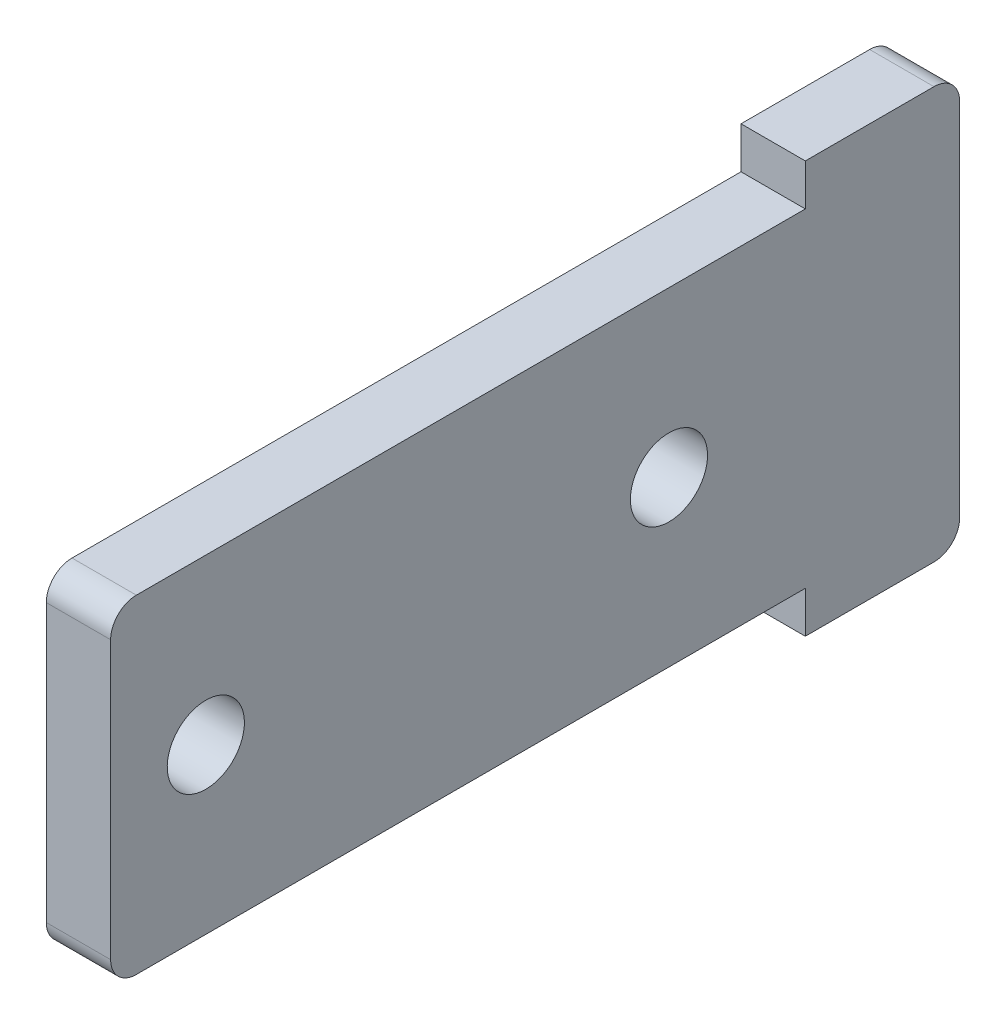
ISO-10303-21;
HEADER;
FILE_DESCRIPTION(('STEP AP214'),'2;1');
FILE_NAME('part.step','',(''),(''),'','','');
FILE_SCHEMA(('AUTOMOTIVE_DESIGN { 1 0 10303 214 1 1 1 1 }'));
ENDSEC;
DATA;
#1=APPLICATION_CONTEXT('core data for automotive mechanical design processes');
#2=APPLICATION_PROTOCOL_DEFINITION('international standard','automotive_design',2000,#1);
#3=PRODUCT_CONTEXT('',#1,'mechanical');
#4=PRODUCT('Part','Part','',(#3));
#5=PRODUCT_RELATED_PRODUCT_CATEGORY('part','',(#4));
#6=PRODUCT_DEFINITION_FORMATION('','',#4);
#7=PRODUCT_DEFINITION_CONTEXT('part definition',#1,'design');
#8=PRODUCT_DEFINITION('design','',#6,#7);
#9=PRODUCT_DEFINITION_SHAPE('','',#8);
#10=(LENGTH_UNIT() NAMED_UNIT(*) SI_UNIT(.MILLI.,.METRE.));
#11=(NAMED_UNIT(*) PLANE_ANGLE_UNIT() SI_UNIT($,.RADIAN.));
#12=(NAMED_UNIT(*) SI_UNIT($,.STERADIAN.) SOLID_ANGLE_UNIT());
#13=UNCERTAINTY_MEASURE_WITH_UNIT(LENGTH_MEASURE(1.E-05),#10,'distance_accuracy_value','');
#14=(GEOMETRIC_REPRESENTATION_CONTEXT(3) GLOBAL_UNCERTAINTY_ASSIGNED_CONTEXT((#13)) GLOBAL_UNIT_ASSIGNED_CONTEXT((#10,
#11,#12)) REPRESENTATION_CONTEXT('',''));
#15=CARTESIAN_POINT('',(0.,0.,0.));
#16=DIRECTION('',(0.,0.,1.));
#17=DIRECTION('',(1.,0.,0.));
#18=AXIS2_PLACEMENT_3D('',#15,#16,#17);
#19=CARTESIAN_POINT('',(-139.654437837841,-38.0629308707487,10.5));
#20=DIRECTION('',(1.,0.,0.));
#21=DIRECTION('',(0.,1.,0.));
#22=AXIS2_PLACEMENT_3D('',#19,#20,#21);
#23=PLANE('',#22);
#24=CARTESIAN_POINT('',(-139.654437837841,-38.0629740155527,23.3));
#25=DIRECTION('',(1.,0.,0.));
#26=DIRECTION('',(0.,1.,0.));
#27=AXIS2_PLACEMENT_3D('',#24,#25,#26);
#28=CIRCLE('',#27,1.5);
#29=CARTESIAN_POINT('',(-139.654437837841,-39.5629740155527,23.3));
#30=VERTEX_POINT('',#29);
#31=EDGE_CURVE('E216',#30,#30,#28,.T.);
#32=ORIENTED_EDGE('',*,*,#31,.T.);
#33=EDGE_LOOP('',(#32));
#34=FACE_BOUND('',#33,.T.);
#35=CARTESIAN_POINT('',(-139.654437837841,-38.0629740155527,5.3));
#36=DIRECTION('',(1.,0.,0.));
#37=DIRECTION('',(0.,1.,0.));
#38=AXIS2_PLACEMENT_3D('',#35,#36,#37);
#39=CIRCLE('',#38,1.5);
#40=CARTESIAN_POINT('',(-139.654437837841,-39.5629740155527,5.3));
#41=VERTEX_POINT('',#40);
#42=EDGE_CURVE('E199',#41,#41,#39,.T.);
#43=ORIENTED_EDGE('',*,*,#42,.T.);
#44=EDGE_LOOP('',(#43));
#45=FACE_BOUND('',#44,.T.);
#46=DIRECTION('',(0.,0.,-1.));
#47=VECTOR('',#46,1.);
#48=CARTESIAN_POINT('',(-139.654437837841,-31.6789674393649,3.));
#49=LINE('',#48,#47);
#50=CARTESIAN_POINT('',(-139.654437837841,-31.6789674393649,26.));
#51=VERTEX_POINT('',#50);
#52=CARTESIAN_POINT('',(-139.654437837841,-31.6789673021326,0.));
#53=VERTEX_POINT('',#52);
#54=EDGE_CURVE('E9',#51,#53,#49,.T.);
#55=ORIENTED_EDGE('',*,*,#54,.T.);
#56=DIRECTION('',(0.,1.,0.));
#57=VECTOR('',#56,1.);
#58=CARTESIAN_POINT('',(-139.654437837841,-31.6789673021326,0.));
#59=LINE('',#58,#57);
#60=CARTESIAN_POINT('',(-139.654437837841,-30.0629308707487,0.));
#61=VERTEX_POINT('',#60);
#62=EDGE_CURVE('E209',#53,#61,#59,.T.);
#63=ORIENTED_EDGE('',*,*,#62,.T.);
#64=DIRECTION('',(0.,0.,-1.));
#65=VECTOR('',#64,1.);
#66=CARTESIAN_POINT('',(-139.654437837841,-30.0629308707487,0.));
#67=LINE('',#66,#65);
#68=CARTESIAN_POINT('',(-139.654437837841,-30.0629308707487,-5.));
#69=VERTEX_POINT('',#68);
#70=EDGE_CURVE('E291',#61,#69,#67,.T.);
#71=ORIENTED_EDGE('',*,*,#70,.T.);
#72=CARTESIAN_POINT('',(-139.654437837841,-31.0629308707487,-5.));
#73=DIRECTION('',(-1.,0.,0.));
#74=DIRECTION('',(0.,0.,-1.));
#75=AXIS2_PLACEMENT_3D('',#72,#73,#74);
#76=CIRCLE('',#75,1.);
#77=CARTESIAN_POINT('',(-139.654437837841,-31.0629308707487,-6.));
#78=VERTEX_POINT('',#77);
#79=EDGE_CURVE('E211',#69,#78,#76,.T.);
#80=ORIENTED_EDGE('',*,*,#79,.T.);
#81=DIRECTION('',(0.,-1.,0.));
#82=VECTOR('',#81,1.);
#83=CARTESIAN_POINT('',(-139.654437837841,-31.0629308707487,-6.));
#84=LINE('',#83,#82);
#85=CARTESIAN_POINT('',(-139.654437837841,-45.0629308707487,-6.));
#86=VERTEX_POINT('',#85);
#87=EDGE_CURVE('E228',#78,#86,#84,.T.);
#88=ORIENTED_EDGE('',*,*,#87,.T.);
#89=CARTESIAN_POINT('',(-139.654437837841,-45.0629308707487,-5.));
#90=DIRECTION('',(-1.,0.,0.));
#91=DIRECTION('',(0.,-1.,0.));
#92=AXIS2_PLACEMENT_3D('',#89,#90,#91);
#93=CIRCLE('',#92,1.);
#94=CARTESIAN_POINT('',(-139.654437837841,-46.0629308707487,-5.));
#95=VERTEX_POINT('',#94);
#96=EDGE_CURVE('E221',#86,#95,#93,.T.);
#97=ORIENTED_EDGE('',*,*,#96,.T.);
#98=DIRECTION('',(0.,0.,1.));
#99=VECTOR('',#98,1.);
#100=CARTESIAN_POINT('',(-139.654437837841,-46.0629308707487,-5.));
#101=LINE('',#100,#99);
#102=CARTESIAN_POINT('',(-139.654437837841,-46.0629308707487,0.));
#103=VERTEX_POINT('',#102);
#104=EDGE_CURVE('E129',#95,#103,#101,.T.);
#105=ORIENTED_EDGE('',*,*,#104,.T.);
#106=DIRECTION('',(0.,1.,0.));
#107=VECTOR('',#106,1.);
#108=CARTESIAN_POINT('',(-139.654437837841,-93.4629740155527,0.));
#109=LINE('',#108,#107);
#110=CARTESIAN_POINT('',(-139.654437837841,-44.4468944393649,0.));
#111=VERTEX_POINT('',#110);
#112=EDGE_CURVE('E255',#103,#111,#109,.T.);
#113=ORIENTED_EDGE('',*,*,#112,.T.);
#114=DIRECTION('',(0.,0.,1.));
#115=VECTOR('',#114,1.);
#116=CARTESIAN_POINT('',(-139.654437837841,-44.4468944393649,26.));
#117=LINE('',#116,#115);
#118=CARTESIAN_POINT('',(-139.654437837841,-44.4468944393649,26.));
#119=VERTEX_POINT('',#118);
#120=EDGE_CURVE('E240',#111,#119,#117,.T.);
#121=ORIENTED_EDGE('',*,*,#120,.T.);
#122=CARTESIAN_POINT('',(-139.654437837841,-43.4468944393649,26.));
#123=DIRECTION('',(-1.,0.,0.));
#124=DIRECTION('',(0.,0.,1.));
#125=AXIS2_PLACEMENT_3D('',#122,#123,#124);
#126=CIRCLE('',#125,1.);
#127=CARTESIAN_POINT('',(-139.654437837841,-43.4468944393649,27.));
#128=VERTEX_POINT('',#127);
#129=EDGE_CURVE('E195',#119,#128,#126,.T.);
#130=ORIENTED_EDGE('',*,*,#129,.T.);
#131=DIRECTION('',(0.,1.,0.));
#132=VECTOR('',#131,1.);
#133=CARTESIAN_POINT('',(-139.654437837841,-32.6789674393649,27.));
#134=LINE('',#133,#132);
#135=CARTESIAN_POINT('',(-139.654437837841,-32.6789674393649,27.));
#136=VERTEX_POINT('',#135);
#137=EDGE_CURVE('E204',#128,#136,#134,.T.);
#138=ORIENTED_EDGE('',*,*,#137,.T.);
#139=CARTESIAN_POINT('',(-139.654437837841,-32.6789674393649,26.));
#140=DIRECTION('',(-1.,0.,0.));
#141=DIRECTION('',(0.,1.,0.));
#142=AXIS2_PLACEMENT_3D('',#139,#140,#141);
#143=CIRCLE('',#142,1.);
#144=EDGE_CURVE('E172',#136,#51,#143,.T.);
#145=ORIENTED_EDGE('',*,*,#144,.T.);
#146=EDGE_LOOP('',(#55,#63,#71,#80,#88,#97,#105,#113,#121,#130,#138,#145));
#147=FACE_BOUND('',#146,.T.);
#148=ADVANCED_FACE('F15',(#34,#45,#147),#23,.F.);
#149=CARTESIAN_POINT('',(-137.154437837841,-38.0629308707487,10.5));
#150=DIRECTION('',(1.,0.,0.));
#151=DIRECTION('',(0.,1.,0.));
#152=AXIS2_PLACEMENT_3D('',#149,#150,#151);
#153=PLANE('',#152);
#154=CARTESIAN_POINT('',(-137.154437837841,-38.0629740155527,23.3));
#155=DIRECTION('',(-1.,0.,0.));
#156=DIRECTION('',(0.,1.,0.));
#157=AXIS2_PLACEMENT_3D('',#154,#155,#156);
#158=CIRCLE('',#157,1.5);
#159=CARTESIAN_POINT('',(-137.154437837841,-39.5629740155527,23.3));
#160=VERTEX_POINT('',#159);
#161=EDGE_CURVE('E203',#160,#160,#158,.T.);
#162=ORIENTED_EDGE('',*,*,#161,.T.);
#163=EDGE_LOOP('',(#162));
#164=FACE_BOUND('',#163,.T.);
#165=CARTESIAN_POINT('',(-137.154437837841,-38.0629740155527,5.3));
#166=DIRECTION('',(-1.,0.,0.));
#167=DIRECTION('',(0.,1.,0.));
#168=AXIS2_PLACEMENT_3D('',#165,#166,#167);
#169=CIRCLE('',#168,1.5);
#170=CARTESIAN_POINT('',(-137.154437837841,-39.5629740155527,5.3));
#171=VERTEX_POINT('',#170);
#172=EDGE_CURVE('E177',#171,#171,#169,.T.);
#173=ORIENTED_EDGE('',*,*,#172,.T.);
#174=EDGE_LOOP('',(#173));
#175=FACE_BOUND('',#174,.T.);
#176=DIRECTION('',(0.,0.,1.));
#177=VECTOR('',#176,1.);
#178=CARTESIAN_POINT('',(-137.154437837841,-31.6789674393649,3.));
#179=LINE('',#178,#177);
#180=CARTESIAN_POINT('',(-137.154437837841,-31.6789673021326,0.));
#181=VERTEX_POINT('',#180);
#182=CARTESIAN_POINT('',(-137.154437837841,-31.6789674393649,26.));
#183=VERTEX_POINT('',#182);
#184=EDGE_CURVE('E25',#181,#183,#179,.T.);
#185=ORIENTED_EDGE('',*,*,#184,.T.);
#186=CARTESIAN_POINT('',(-137.154437837841,-32.6789674393649,26.));
#187=DIRECTION('',(1.,0.,0.));
#188=DIRECTION('',(0.,1.,0.));
#189=AXIS2_PLACEMENT_3D('',#186,#187,#188);
#190=CIRCLE('',#189,1.);
#191=CARTESIAN_POINT('',(-137.154437837841,-32.6789674393649,27.));
#192=VERTEX_POINT('',#191);
#193=EDGE_CURVE('E159',#183,#192,#190,.T.);
#194=ORIENTED_EDGE('',*,*,#193,.T.);
#195=DIRECTION('',(0.,-1.,0.));
#196=VECTOR('',#195,1.);
#197=CARTESIAN_POINT('',(-137.154437837841,-32.6789674393649,27.));
#198=LINE('',#197,#196);
#199=CARTESIAN_POINT('',(-137.154437837841,-43.4468944393649,27.));
#200=VERTEX_POINT('',#199);
#201=EDGE_CURVE('E151',#192,#200,#198,.T.);
#202=ORIENTED_EDGE('',*,*,#201,.T.);
#203=CARTESIAN_POINT('',(-137.154437837841,-43.4468944393649,26.));
#204=DIRECTION('',(1.,0.,0.));
#205=DIRECTION('',(0.,0.,1.));
#206=AXIS2_PLACEMENT_3D('',#203,#204,#205);
#207=CIRCLE('',#206,1.);
#208=CARTESIAN_POINT('',(-137.154437837841,-44.4468944393649,26.));
#209=VERTEX_POINT('',#208);
#210=EDGE_CURVE('E191',#200,#209,#207,.T.);
#211=ORIENTED_EDGE('',*,*,#210,.T.);
#212=DIRECTION('',(0.,0.,-1.));
#213=VECTOR('',#212,1.);
#214=CARTESIAN_POINT('',(-137.154437837841,-44.4468944393649,26.));
#215=LINE('',#214,#213);
#216=CARTESIAN_POINT('',(-137.154437837841,-44.4468944393649,0.));
#217=VERTEX_POINT('',#216);
#218=EDGE_CURVE('E250',#209,#217,#215,.T.);
#219=ORIENTED_EDGE('',*,*,#218,.T.);
#220=DIRECTION('',(0.,1.,0.));
#221=VECTOR('',#220,1.);
#222=CARTESIAN_POINT('',(-137.154437837841,-93.4629740155527,0.));
#223=LINE('',#222,#221);
#224=CARTESIAN_POINT('',(-137.154437837841,-46.0629308707487,0.));
#225=VERTEX_POINT('',#224);
#226=EDGE_CURVE('E239',#225,#217,#223,.T.);
#227=ORIENTED_EDGE('',*,*,#226,.F.);
#228=DIRECTION('',(0.,0.,1.));
#229=VECTOR('',#228,1.);
#230=CARTESIAN_POINT('',(-137.154437837841,-46.0629308707487,-5.));
#231=LINE('',#230,#229);
#232=CARTESIAN_POINT('',(-137.154437837841,-46.0629308707487,-5.));
#233=VERTEX_POINT('',#232);
#234=EDGE_CURVE('E246',#233,#225,#231,.T.);
#235=ORIENTED_EDGE('',*,*,#234,.F.);
#236=CARTESIAN_POINT('',(-137.154437837841,-45.0629308707487,-5.));
#237=DIRECTION('',(1.,0.,0.));
#238=DIRECTION('',(0.,-1.,0.));
#239=AXIS2_PLACEMENT_3D('',#236,#237,#238);
#240=CIRCLE('',#239,1.);
#241=CARTESIAN_POINT('',(-137.154437837841,-45.0629308707487,-6.));
#242=VERTEX_POINT('',#241);
#243=EDGE_CURVE('E120',#233,#242,#240,.T.);
#244=ORIENTED_EDGE('',*,*,#243,.T.);
#245=DIRECTION('',(0.,-1.,0.));
#246=VECTOR('',#245,1.);
#247=CARTESIAN_POINT('',(-137.154437837841,-31.0629308707487,-6.));
#248=LINE('',#247,#246);
#249=CARTESIAN_POINT('',(-137.154437837841,-31.0629308707487,-6.));
#250=VERTEX_POINT('',#249);
#251=EDGE_CURVE('E225',#250,#242,#248,.T.);
#252=ORIENTED_EDGE('',*,*,#251,.F.);
#253=CARTESIAN_POINT('',(-137.154437837841,-31.0629308707487,-5.));
#254=DIRECTION('',(1.,0.,0.));
#255=DIRECTION('',(0.,0.,-1.));
#256=AXIS2_PLACEMENT_3D('',#253,#254,#255);
#257=CIRCLE('',#256,1.);
#258=CARTESIAN_POINT('',(-137.154437837841,-30.0629308707487,-5.));
#259=VERTEX_POINT('',#258);
#260=EDGE_CURVE('E215',#250,#259,#257,.T.);
#261=ORIENTED_EDGE('',*,*,#260,.T.);
#262=DIRECTION('',(0.,0.,-1.));
#263=VECTOR('',#262,1.);
#264=CARTESIAN_POINT('',(-137.154437837841,-30.0629308707487,0.));
#265=LINE('',#264,#263);
#266=CARTESIAN_POINT('',(-137.154437837841,-30.0629308707487,0.));
#267=VERTEX_POINT('',#266);
#268=EDGE_CURVE('E19',#267,#259,#265,.T.);
#269=ORIENTED_EDGE('',*,*,#268,.F.);
#270=DIRECTION('',(0.,1.,0.));
#271=VECTOR('',#270,1.);
#272=CARTESIAN_POINT('',(-137.154437837841,-31.6789673021326,0.));
#273=LINE('',#272,#271);
#274=EDGE_CURVE('E162',#181,#267,#273,.T.);
#275=ORIENTED_EDGE('',*,*,#274,.F.);
#276=EDGE_LOOP('',(#185,#194,#202,#211,#219,#227,#235,#244,#252,#261,#269,#275));
#277=FACE_BOUND('',#276,.T.);
#278=ADVANCED_FACE('F157',(#164,#175,#277),#153,.T.);
#279=CARTESIAN_POINT('',(-137.154437837841,-31.6789674393649,26.));
#280=DIRECTION('',(0.,1.,0.));
#281=DIRECTION('',(1.,0.,0.));
#282=AXIS2_PLACEMENT_3D('',#279,#280,#281);
#283=PLANE('',#282);
#284=ORIENTED_EDGE('',*,*,#184,.F.);
#285=DIRECTION('',(-1.,0.,0.));
#286=VECTOR('',#285,1.);
#287=CARTESIAN_POINT('',(-137.154437837841,-31.6789673021326,0.));
#288=LINE('',#287,#286);
#289=EDGE_CURVE('E164',#181,#53,#288,.T.);
#290=ORIENTED_EDGE('',*,*,#289,.T.);
#291=ORIENTED_EDGE('',*,*,#54,.F.);
#292=DIRECTION('',(-1.,0.,0.));
#293=VECTOR('',#292,1.);
#294=CARTESIAN_POINT('',(-137.154437837841,-31.6789674393649,26.));
#295=LINE('',#294,#293);
#296=EDGE_CURVE('E167',#183,#51,#295,.T.);
#297=ORIENTED_EDGE('',*,*,#296,.F.);
#298=EDGE_LOOP('',(#284,#290,#291,#297));
#299=FACE_BOUND('',#298,.T.);
#300=ADVANCED_FACE('F168',(#299),#283,.T.);
#301=CARTESIAN_POINT('',(-137.154437837841,-31.6789673021326,0.));
#302=DIRECTION('',(0.,0.,1.));
#303=DIRECTION('',(1.,0.,0.));
#304=AXIS2_PLACEMENT_3D('',#301,#302,#303);
#305=PLANE('',#304);
#306=ORIENTED_EDGE('',*,*,#274,.T.);
#307=DIRECTION('',(-1.,0.,0.));
#308=VECTOR('',#307,1.);
#309=CARTESIAN_POINT('',(-137.154437837841,-30.0629308707487,0.));
#310=LINE('',#309,#308);
#311=EDGE_CURVE('E210',#267,#61,#310,.T.);
#312=ORIENTED_EDGE('',*,*,#311,.T.);
#313=ORIENTED_EDGE('',*,*,#62,.F.);
#314=ORIENTED_EDGE('',*,*,#289,.F.);
#315=EDGE_LOOP('',(#306,#312,#313,#314));
#316=FACE_BOUND('',#315,.T.);
#317=ADVANCED_FACE('F338',(#316),#305,.T.);
#318=CARTESIAN_POINT('',(-137.154437837841,-30.0629308707487,0.));
#319=DIRECTION('',(0.,1.,0.));
#320=DIRECTION('',(1.,0.,0.));
#321=AXIS2_PLACEMENT_3D('',#318,#319,#320);
#322=PLANE('',#321);
#323=ORIENTED_EDGE('',*,*,#268,.T.);
#324=DIRECTION('',(-1.,0.,0.));
#325=VECTOR('',#324,1.);
#326=CARTESIAN_POINT('',(-137.154437837841,-30.0629308707487,-5.));
#327=LINE('',#326,#325);
#328=EDGE_CURVE('E214',#259,#69,#327,.T.);
#329=ORIENTED_EDGE('',*,*,#328,.T.);
#330=ORIENTED_EDGE('',*,*,#70,.F.);
#331=ORIENTED_EDGE('',*,*,#311,.F.);
#332=EDGE_LOOP('',(#323,#329,#330,#331));
#333=FACE_BOUND('',#332,.T.);
#334=ADVANCED_FACE('F340',(#333),#322,.T.);
#335=CARTESIAN_POINT('',(-137.154437837841,-31.0629308707487,-5.));
#336=DIRECTION('',(-1.,0.,0.));
#337=DIRECTION('',(0.,0.,-1.));
#338=AXIS2_PLACEMENT_3D('',#335,#336,#337);
#339=CYLINDRICAL_SURFACE('',#338,1.);
#340=ORIENTED_EDGE('',*,*,#260,.F.);
#341=DIRECTION('',(-1.,0.,0.));
#342=VECTOR('',#341,1.);
#343=CARTESIAN_POINT('',(-137.154437837841,-31.0629308707487,-6.));
#344=LINE('',#343,#342);
#345=EDGE_CURVE('E234',#250,#78,#344,.T.);
#346=ORIENTED_EDGE('',*,*,#345,.T.);
#347=ORIENTED_EDGE('',*,*,#79,.F.);
#348=ORIENTED_EDGE('',*,*,#328,.F.);
#349=EDGE_LOOP('',(#340,#346,#347,#348));
#350=FACE_BOUND('',#349,.T.);
#351=ADVANCED_FACE('F17',(#350),#339,.T.);
#352=CARTESIAN_POINT('',(-137.154437837841,-31.0629308707487,-6.));
#353=DIRECTION('',(0.,0.,-1.));
#354=DIRECTION('',(0.,-1.,0.));
#355=AXIS2_PLACEMENT_3D('',#352,#353,#354);
#356=PLANE('',#355);
#357=ORIENTED_EDGE('',*,*,#251,.T.);
#358=DIRECTION('',(-1.,0.,0.));
#359=VECTOR('',#358,1.);
#360=CARTESIAN_POINT('',(-137.154437837841,-45.0629308707487,-6.));
#361=LINE('',#360,#359);
#362=EDGE_CURVE('E224',#242,#86,#361,.T.);
#363=ORIENTED_EDGE('',*,*,#362,.T.);
#364=ORIENTED_EDGE('',*,*,#87,.F.);
#365=ORIENTED_EDGE('',*,*,#345,.F.);
#366=EDGE_LOOP('',(#357,#363,#364,#365));
#367=FACE_BOUND('',#366,.T.);
#368=ADVANCED_FACE('F461',(#367),#356,.T.);
#369=CARTESIAN_POINT('',(-137.154437837841,-45.0629308707487,-5.));
#370=DIRECTION('',(-1.,0.,0.));
#371=DIRECTION('',(0.,-1.,0.));
#372=AXIS2_PLACEMENT_3D('',#369,#370,#371);
#373=CYLINDRICAL_SURFACE('',#372,1.);
#374=ORIENTED_EDGE('',*,*,#243,.F.);
#375=DIRECTION('',(-1.,0.,0.));
#376=VECTOR('',#375,1.);
#377=CARTESIAN_POINT('',(-137.154437837841,-46.0629308707487,-5.));
#378=LINE('',#377,#376);
#379=EDGE_CURVE('E196',#233,#95,#378,.T.);
#380=ORIENTED_EDGE('',*,*,#379,.T.);
#381=ORIENTED_EDGE('',*,*,#96,.F.);
#382=ORIENTED_EDGE('',*,*,#362,.F.);
#383=EDGE_LOOP('',(#374,#380,#381,#382));
#384=FACE_BOUND('',#383,.T.);
#385=ADVANCED_FACE('F503',(#384),#373,.T.);
#386=CARTESIAN_POINT('',(-137.154437837841,-46.0629308707487,-5.));
#387=DIRECTION('',(0.,-1.,0.));
#388=DIRECTION('',(0.,0.,-1.));
#389=AXIS2_PLACEMENT_3D('',#386,#387,#388);
#390=PLANE('',#389);
#391=ORIENTED_EDGE('',*,*,#234,.T.);
#392=DIRECTION('',(-1.,0.,0.));
#393=VECTOR('',#392,1.);
#394=CARTESIAN_POINT('',(-137.154437837841,-46.0629308707487,0.));
#395=LINE('',#394,#393);
#396=EDGE_CURVE('E249',#225,#103,#395,.T.);
#397=ORIENTED_EDGE('',*,*,#396,.T.);
#398=ORIENTED_EDGE('',*,*,#104,.F.);
#399=ORIENTED_EDGE('',*,*,#379,.F.);
#400=EDGE_LOOP('',(#391,#397,#398,#399));
#401=FACE_BOUND('',#400,.T.);
#402=ADVANCED_FACE('F336',(#401),#390,.T.);
#403=CARTESIAN_POINT('',(-137.154437837841,-46.0629308707487,0.));
#404=DIRECTION('',(0.,0.,1.));
#405=DIRECTION('',(1.,0.,0.));
#406=AXIS2_PLACEMENT_3D('',#403,#404,#405);
#407=PLANE('',#406);
#408=ORIENTED_EDGE('',*,*,#226,.T.);
#409=DIRECTION('',(-1.,0.,0.));
#410=VECTOR('',#409,1.);
#411=CARTESIAN_POINT('',(-137.154437837841,-44.4468944393649,0.));
#412=LINE('',#411,#410);
#413=EDGE_CURVE('E235',#217,#111,#412,.T.);
#414=ORIENTED_EDGE('',*,*,#413,.T.);
#415=ORIENTED_EDGE('',*,*,#112,.F.);
#416=ORIENTED_EDGE('',*,*,#396,.F.);
#417=EDGE_LOOP('',(#408,#414,#415,#416));
#418=FACE_BOUND('',#417,.T.);
#419=ADVANCED_FACE('F334',(#418),#407,.T.);
#420=CARTESIAN_POINT('',(-137.154437837841,-44.4468944393649,0.));
#421=DIRECTION('',(0.,-1.,0.));
#422=DIRECTION('',(0.,0.,-1.));
#423=AXIS2_PLACEMENT_3D('',#420,#421,#422);
#424=PLANE('',#423);
#425=ORIENTED_EDGE('',*,*,#218,.F.);
#426=DIRECTION('',(-1.,0.,0.));
#427=VECTOR('',#426,1.);
#428=CARTESIAN_POINT('',(-137.154437837841,-44.4468944393649,26.));
#429=LINE('',#428,#427);
#430=EDGE_CURVE('E254',#209,#119,#429,.T.);
#431=ORIENTED_EDGE('',*,*,#430,.T.);
#432=ORIENTED_EDGE('',*,*,#120,.F.);
#433=ORIENTED_EDGE('',*,*,#413,.F.);
#434=EDGE_LOOP('',(#425,#431,#432,#433));
#435=FACE_BOUND('',#434,.T.);
#436=ADVANCED_FACE('F318',(#435),#424,.T.);
#437=CARTESIAN_POINT('',(-137.154437837841,-43.4468944393649,26.));
#438=DIRECTION('',(-1.,0.,0.));
#439=DIRECTION('',(0.,0.,1.));
#440=AXIS2_PLACEMENT_3D('',#437,#438,#439);
#441=CYLINDRICAL_SURFACE('',#440,1.);
#442=ORIENTED_EDGE('',*,*,#210,.F.);
#443=DIRECTION('',(-1.,0.,0.));
#444=VECTOR('',#443,1.);
#445=CARTESIAN_POINT('',(-137.154437837841,-43.4468944393649,27.));
#446=LINE('',#445,#444);
#447=EDGE_CURVE('E186',#200,#128,#446,.T.);
#448=ORIENTED_EDGE('',*,*,#447,.T.);
#449=ORIENTED_EDGE('',*,*,#129,.F.);
#450=ORIENTED_EDGE('',*,*,#430,.F.);
#451=EDGE_LOOP('',(#442,#448,#449,#450));
#452=FACE_BOUND('',#451,.T.);
#453=ADVANCED_FACE('F309',(#452),#441,.T.);
#454=CARTESIAN_POINT('',(-137.154437837841,-43.4468944393649,27.));
#455=DIRECTION('',(0.,0.,1.));
#456=DIRECTION('',(1.,0.,0.));
#457=AXIS2_PLACEMENT_3D('',#454,#455,#456);
#458=PLANE('',#457);
#459=ORIENTED_EDGE('',*,*,#201,.F.);
#460=DIRECTION('',(-1.,0.,0.));
#461=VECTOR('',#460,1.);
#462=CARTESIAN_POINT('',(-137.154437837841,-32.6789674393649,27.));
#463=LINE('',#462,#461);
#464=EDGE_CURVE('E175',#192,#136,#463,.T.);
#465=ORIENTED_EDGE('',*,*,#464,.T.);
#466=ORIENTED_EDGE('',*,*,#137,.F.);
#467=ORIENTED_EDGE('',*,*,#447,.F.);
#468=EDGE_LOOP('',(#459,#465,#466,#467));
#469=FACE_BOUND('',#468,.T.);
#470=ADVANCED_FACE('F307',(#469),#458,.T.);
#471=CARTESIAN_POINT('',(-137.154437837841,-32.6789674393649,26.));
#472=DIRECTION('',(-1.,0.,0.));
#473=DIRECTION('',(0.,1.,0.));
#474=AXIS2_PLACEMENT_3D('',#471,#472,#473);
#475=CYLINDRICAL_SURFACE('',#474,1.);
#476=ORIENTED_EDGE('',*,*,#193,.F.);
#477=ORIENTED_EDGE('',*,*,#296,.T.);
#478=ORIENTED_EDGE('',*,*,#144,.F.);
#479=ORIENTED_EDGE('',*,*,#464,.F.);
#480=EDGE_LOOP('',(#476,#477,#478,#479));
#481=FACE_BOUND('',#480,.T.);
#482=ADVANCED_FACE('F174',(#481),#475,.T.);
#483=CARTESIAN_POINT('',(-137.154437837841,-38.0629740155527,5.3));
#484=DIRECTION('',(-1.,0.,0.));
#485=DIRECTION('',(0.,1.,0.));
#486=AXIS2_PLACEMENT_3D('',#483,#484,#485);
#487=CYLINDRICAL_SURFACE('',#486,1.5);
#488=ORIENTED_EDGE('',*,*,#42,.F.);
#489=DIRECTION('',(1.,0.,0.));
#490=VECTOR('',#489,1.);
#491=CARTESIAN_POINT('',(-137.154437837841,-39.5629740155527,5.3));
#492=LINE('',#491,#490);
#493=EDGE_CURVE('E183',#41,#171,#492,.T.);
#494=ORIENTED_EDGE('',*,*,#493,.T.);
#495=ORIENTED_EDGE('',*,*,#172,.F.);
#496=ORIENTED_EDGE('',*,*,#493,.F.);
#497=EDGE_LOOP('',(#488,#494,#495,#496));
#498=FACE_BOUND('',#497,.T.);
#499=ADVANCED_FACE('F316',(#498),#487,.F.);
#500=CARTESIAN_POINT('',(-137.154437837841,-38.0629740155527,23.3));
#501=DIRECTION('',(-1.,0.,0.));
#502=DIRECTION('',(0.,1.,0.));
#503=AXIS2_PLACEMENT_3D('',#500,#501,#502);
#504=CYLINDRICAL_SURFACE('',#503,1.5);
#505=ORIENTED_EDGE('',*,*,#31,.F.);
#506=DIRECTION('',(1.,0.,0.));
#507=VECTOR('',#506,1.);
#508=CARTESIAN_POINT('',(-137.154437837841,-39.5629740155527,23.3));
#509=LINE('',#508,#507);
#510=EDGE_CURVE('E220',#30,#160,#509,.T.);
#511=ORIENTED_EDGE('',*,*,#510,.T.);
#512=ORIENTED_EDGE('',*,*,#161,.F.);
#513=ORIENTED_EDGE('',*,*,#510,.F.);
#514=EDGE_LOOP('',(#505,#511,#512,#513));
#515=FACE_BOUND('',#514,.T.);
#516=ADVANCED_FACE('F494',(#515),#504,.F.);
#517=CLOSED_SHELL('',(#148,#278,#300,#317,#334,#351,#368,#385,#402,#419,#436,#453,#470,#482,
#499,#516));
#518=MANIFOLD_SOLID_BREP('B1',#517);
#519=ADVANCED_BREP_SHAPE_REPRESENTATION('',(#18,#518),#14);
#520=SHAPE_DEFINITION_REPRESENTATION(#9,#519);
ENDSEC;
END-ISO-10303-21;
